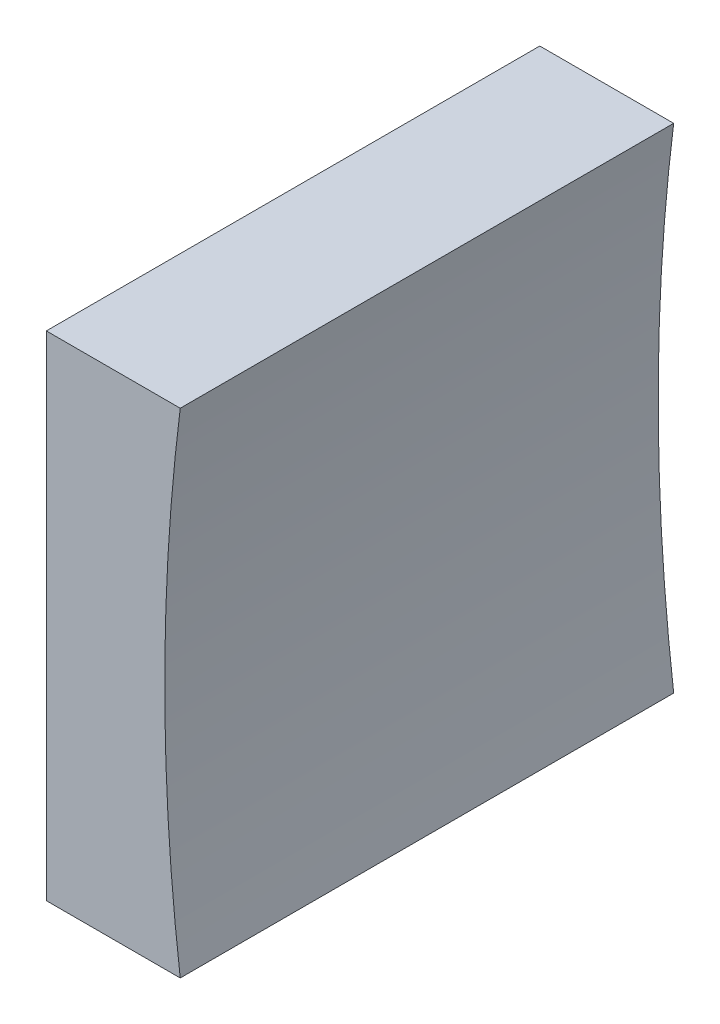
ISO-10303-21;
HEADER;
FILE_DESCRIPTION(('STEP AP214'),'2;1');
FILE_NAME('part.step','',(''),(''),'','','');
FILE_SCHEMA(('AUTOMOTIVE_DESIGN { 1 0 10303 214 1 1 1 1 }'));
ENDSEC;
DATA;
#1=APPLICATION_CONTEXT('core data for automotive mechanical design processes');
#2=APPLICATION_PROTOCOL_DEFINITION('international standard','automotive_design',2000,#1);
#3=PRODUCT_CONTEXT('',#1,'mechanical');
#4=PRODUCT('Part','Part','',(#3));
#5=PRODUCT_RELATED_PRODUCT_CATEGORY('part','',(#4));
#6=PRODUCT_DEFINITION_FORMATION('','',#4);
#7=PRODUCT_DEFINITION_CONTEXT('part definition',#1,'design');
#8=PRODUCT_DEFINITION('design','',#6,#7);
#9=PRODUCT_DEFINITION_SHAPE('','',#8);
#10=(LENGTH_UNIT() NAMED_UNIT(*) SI_UNIT(.MILLI.,.METRE.));
#11=(NAMED_UNIT(*) PLANE_ANGLE_UNIT() SI_UNIT($,.RADIAN.));
#12=(NAMED_UNIT(*) SI_UNIT($,.STERADIAN.) SOLID_ANGLE_UNIT());
#13=UNCERTAINTY_MEASURE_WITH_UNIT(LENGTH_MEASURE(1.E-05),#10,'distance_accuracy_value','');
#14=(GEOMETRIC_REPRESENTATION_CONTEXT(3) GLOBAL_UNCERTAINTY_ASSIGNED_CONTEXT((#13)) GLOBAL_UNIT_ASSIGNED_CONTEXT((#10,
#11,#12)) REPRESENTATION_CONTEXT('',''));
#15=CARTESIAN_POINT('',(0.,0.,0.));
#16=DIRECTION('',(0.,0.,1.));
#17=DIRECTION('',(1.,0.,0.));
#18=AXIS2_PLACEMENT_3D('',#15,#16,#17);
#19=CARTESIAN_POINT('',(291.491461496117,54.3579292677671,25.));
#20=DIRECTION('',(0.,1.,0.));
#21=DIRECTION('',(0.,0.,1.));
#22=AXIS2_PLACEMENT_3D('',#19,#20,#21);
#23=PLANE('',#22);
#24=DIRECTION('',(1.,0.,0.));
#25=VECTOR('',#24,1.);
#26=CARTESIAN_POINT('',(291.491461496117,54.3579292677671,0.));
#27=LINE('',#26,#25);
#28=CARTESIAN_POINT('',(284.707135631282,54.3579292677671,0.));
#29=VERTEX_POINT('',#28);
#30=CARTESIAN_POINT('',(291.491461496117,54.3579292677671,0.));
#31=VERTEX_POINT('',#30);
#32=EDGE_CURVE('E91',#29,#31,#27,.T.);
#33=ORIENTED_EDGE('',*,*,#32,.T.);
#34=DIRECTION('',(0.,0.,-1.));
#35=VECTOR('',#34,1.);
#36=CARTESIAN_POINT('',(291.491461496117,54.3579292677671,25.));
#37=LINE('',#36,#35);
#38=CARTESIAN_POINT('',(291.491461496117,54.3579292677671,25.));
#39=VERTEX_POINT('',#38);
#40=EDGE_CURVE('E45',#39,#31,#37,.T.);
#41=ORIENTED_EDGE('',*,*,#40,.F.);
#42=DIRECTION('',(1.,0.,0.));
#43=VECTOR('',#42,1.);
#44=CARTESIAN_POINT('',(291.491461496117,54.3579292677671,25.));
#45=LINE('',#44,#43);
#46=CARTESIAN_POINT('',(284.707135631282,54.3579292677671,25.));
#47=VERTEX_POINT('',#46);
#48=EDGE_CURVE('E84',#47,#39,#45,.T.);
#49=ORIENTED_EDGE('',*,*,#48,.F.);
#50=DIRECTION('',(0.,0.,-1.));
#51=VECTOR('',#50,1.);
#52=CARTESIAN_POINT('',(284.707135631282,54.3579292677671,25.));
#53=LINE('',#52,#51);
#54=EDGE_CURVE('E11',#47,#29,#53,.T.);
#55=ORIENTED_EDGE('',*,*,#54,.T.);
#56=EDGE_LOOP('',(#33,#41,#49,#55));
#57=FACE_BOUND('',#56,.T.);
#58=ADVANCED_FACE('F37',(#57),#23,.F.);
#59=CARTESIAN_POINT('',(390.70713566104,66.8579292677668,25.));
#60=DIRECTION('',(0.,0.,-1.));
#61=DIRECTION('',(-1.,0.,0.));
#62=AXIS2_PLACEMENT_3D('',#59,#60,#61);
#63=CYLINDRICAL_SURFACE('',#62,100.);
#64=CARTESIAN_POINT('',(390.70713566104,66.8579292677668,0.));
#65=DIRECTION('',(0.,0.,-1.));
#66=DIRECTION('',(1.,0.,0.));
#67=AXIS2_PLACEMENT_3D('',#64,#65,#66);
#68=CIRCLE('',#67,100.);
#69=CARTESIAN_POINT('',(291.491461496118,79.3579292677671,0.));
#70=VERTEX_POINT('',#69);
#71=EDGE_CURVE('E71',#31,#70,#68,.T.);
#72=ORIENTED_EDGE('',*,*,#71,.T.);
#73=DIRECTION('',(0.,0.,-1.));
#74=VECTOR('',#73,1.);
#75=CARTESIAN_POINT('',(291.491461496118,79.3579292677671,25.));
#76=LINE('',#75,#74);
#77=CARTESIAN_POINT('',(291.491461496118,79.3579292677671,25.));
#78=VERTEX_POINT('',#77);
#79=EDGE_CURVE('E92',#78,#70,#76,.T.);
#80=ORIENTED_EDGE('',*,*,#79,.F.);
#81=CARTESIAN_POINT('',(390.70713566104,66.8579292677668,25.));
#82=DIRECTION('',(0.,0.,-1.));
#83=DIRECTION('',(1.,0.,0.));
#84=AXIS2_PLACEMENT_3D('',#81,#82,#83);
#85=CIRCLE('',#84,100.);
#86=EDGE_CURVE('E88',#39,#78,#85,.T.);
#87=ORIENTED_EDGE('',*,*,#86,.F.);
#88=ORIENTED_EDGE('',*,*,#40,.T.);
#89=EDGE_LOOP('',(#72,#80,#87,#88));
#90=FACE_BOUND('',#89,.T.);
#91=ADVANCED_FACE('F93',(#90),#63,.F.);
#92=CARTESIAN_POINT('',(284.707135631282,79.3579292677671,25.));
#93=DIRECTION('',(0.,-1.,0.));
#94=DIRECTION('',(0.,0.,-1.));
#95=AXIS2_PLACEMENT_3D('',#92,#93,#94);
#96=PLANE('',#95);
#97=DIRECTION('',(-1.,0.,0.));
#98=VECTOR('',#97,1.);
#99=CARTESIAN_POINT('',(284.707135631282,79.3579292677671,0.));
#100=LINE('',#99,#98);
#101=CARTESIAN_POINT('',(284.707135631282,79.3579292677671,0.));
#102=VERTEX_POINT('',#101);
#103=EDGE_CURVE('E78',#70,#102,#100,.T.);
#104=ORIENTED_EDGE('',*,*,#103,.T.);
#105=DIRECTION('',(0.,0.,-1.));
#106=VECTOR('',#105,1.);
#107=CARTESIAN_POINT('',(284.707135631282,79.3579292677671,25.));
#108=LINE('',#107,#106);
#109=CARTESIAN_POINT('',(284.707135631282,79.3579292677671,25.));
#110=VERTEX_POINT('',#109);
#111=EDGE_CURVE('E97',#110,#102,#108,.T.);
#112=ORIENTED_EDGE('',*,*,#111,.F.);
#113=DIRECTION('',(-1.,0.,0.));
#114=VECTOR('',#113,1.);
#115=CARTESIAN_POINT('',(284.707135631282,79.3579292677671,25.));
#116=LINE('',#115,#114);
#117=EDGE_CURVE('E95',#78,#110,#116,.T.);
#118=ORIENTED_EDGE('',*,*,#117,.F.);
#119=ORIENTED_EDGE('',*,*,#79,.T.);
#120=EDGE_LOOP('',(#104,#112,#118,#119));
#121=FACE_BOUND('',#120,.T.);
#122=ADVANCED_FACE('F107',(#121),#96,.F.);
#123=CARTESIAN_POINT('',(284.707135631282,66.8579292677671,25.));
#124=DIRECTION('',(1.,0.,0.));
#125=DIRECTION('',(0.,0.,-1.));
#126=AXIS2_PLACEMENT_3D('',#123,#124,#125);
#127=PLANE('',#126);
#128=DIRECTION('',(0.,-1.,0.));
#129=VECTOR('',#128,1.);
#130=CARTESIAN_POINT('',(284.707135631282,66.8579292677671,0.));
#131=LINE('',#130,#129);
#132=EDGE_CURVE('E104',#102,#29,#131,.T.);
#133=ORIENTED_EDGE('',*,*,#132,.T.);
#134=ORIENTED_EDGE('',*,*,#54,.F.);
#135=DIRECTION('',(0.,-1.,0.));
#136=VECTOR('',#135,1.);
#137=CARTESIAN_POINT('',(284.707135631282,54.3579292677671,25.));
#138=LINE('',#137,#136);
#139=EDGE_CURVE('E53',#110,#47,#138,.T.);
#140=ORIENTED_EDGE('',*,*,#139,.F.);
#141=ORIENTED_EDGE('',*,*,#111,.T.);
#142=EDGE_LOOP('',(#133,#134,#140,#141));
#143=FACE_BOUND('',#142,.T.);
#144=ADVANCED_FACE('F111',(#143),#127,.F.);
#145=CARTESIAN_POINT('',(390.70713566104,66.8579292677668,25.));
#146=DIRECTION('',(0.,0.,1.));
#147=DIRECTION('',(1.,0.,0.));
#148=AXIS2_PLACEMENT_3D('',#145,#146,#147);
#149=PLANE('',#148);
#150=ORIENTED_EDGE('',*,*,#139,.T.);
#151=ORIENTED_EDGE('',*,*,#48,.T.);
#152=ORIENTED_EDGE('',*,*,#86,.T.);
#153=ORIENTED_EDGE('',*,*,#117,.T.);
#154=EDGE_LOOP('',(#150,#151,#152,#153));
#155=FACE_BOUND('',#154,.T.);
#156=ADVANCED_FACE('F86',(#155),#149,.T.);
#157=CARTESIAN_POINT('',(390.70713566104,66.8579292677668,0.));
#158=DIRECTION('',(0.,0.,1.));
#159=DIRECTION('',(1.,0.,0.));
#160=AXIS2_PLACEMENT_3D('',#157,#158,#159);
#161=PLANE('',#160);
#162=ORIENTED_EDGE('',*,*,#32,.F.);
#163=ORIENTED_EDGE('',*,*,#132,.F.);
#164=ORIENTED_EDGE('',*,*,#103,.F.);
#165=ORIENTED_EDGE('',*,*,#71,.F.);
#166=EDGE_LOOP('',(#162,#163,#164,#165));
#167=FACE_BOUND('',#166,.T.);
#168=ADVANCED_FACE('F110',(#167),#161,.F.);
#169=CLOSED_SHELL('',(#58,#91,#122,#144,#156,#168));
#170=MANIFOLD_SOLID_BREP('B2',#169);
#171=ADVANCED_BREP_SHAPE_REPRESENTATION('',(#18,#170),#14);
#172=SHAPE_DEFINITION_REPRESENTATION(#9,#171);
ENDSEC;
END-ISO-10303-21;
